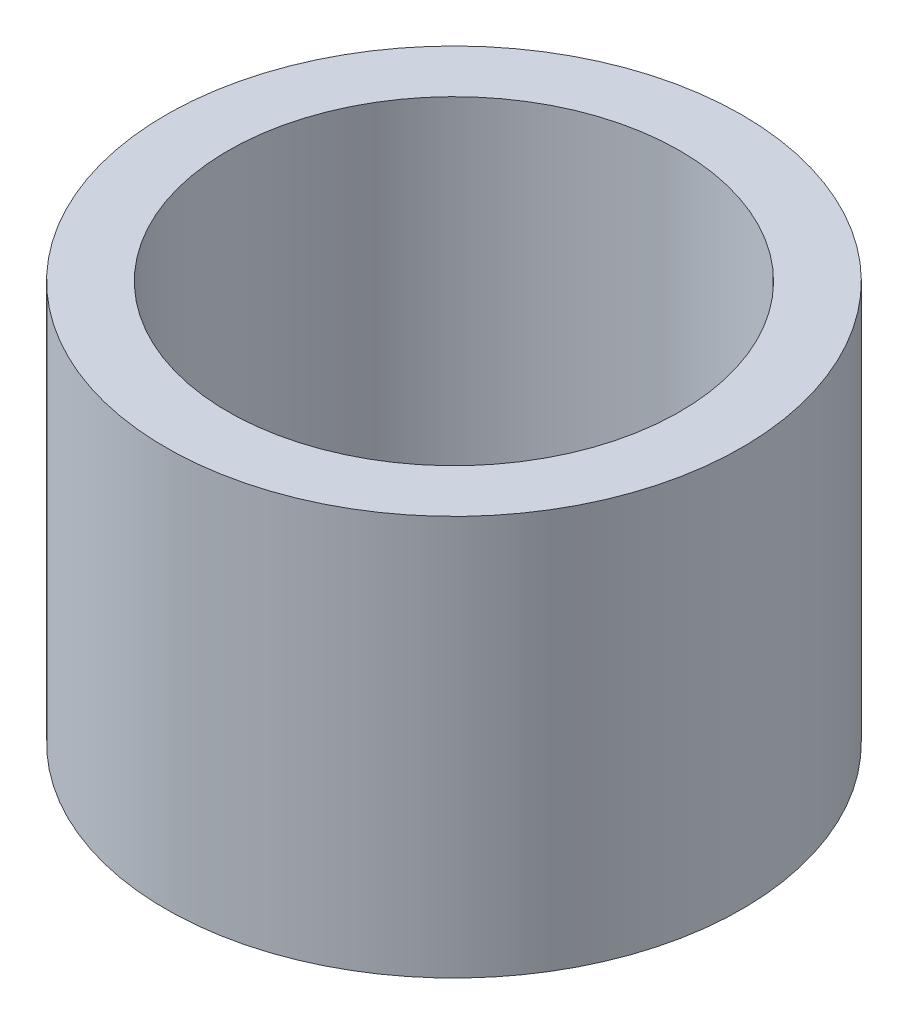
ISO-10303-21;
HEADER;
FILE_DESCRIPTION(('STEP AP214'),'2;1');
FILE_NAME('part.step','',(''),(''),'','','');
FILE_SCHEMA(('AUTOMOTIVE_DESIGN { 1 0 10303 214 1 1 1 1 }'));
ENDSEC;
DATA;
#1=APPLICATION_CONTEXT('core data for automotive mechanical design processes');
#2=APPLICATION_PROTOCOL_DEFINITION('international standard','automotive_design',2000,#1);
#3=PRODUCT_CONTEXT('',#1,'mechanical');
#4=PRODUCT('Part','Part','',(#3));
#5=PRODUCT_RELATED_PRODUCT_CATEGORY('part','',(#4));
#6=PRODUCT_DEFINITION_FORMATION('','',#4);
#7=PRODUCT_DEFINITION_CONTEXT('part definition',#1,'design');
#8=PRODUCT_DEFINITION('design','',#6,#7);
#9=PRODUCT_DEFINITION_SHAPE('','',#8);
#10=(LENGTH_UNIT() NAMED_UNIT(*) SI_UNIT(.MILLI.,.METRE.));
#11=(NAMED_UNIT(*) PLANE_ANGLE_UNIT() SI_UNIT($,.RADIAN.));
#12=(NAMED_UNIT(*) SI_UNIT($,.STERADIAN.) SOLID_ANGLE_UNIT());
#13=UNCERTAINTY_MEASURE_WITH_UNIT(LENGTH_MEASURE(1.E-05),#10,'distance_accuracy_value','');
#14=(GEOMETRIC_REPRESENTATION_CONTEXT(3) GLOBAL_UNCERTAINTY_ASSIGNED_CONTEXT((#13)) GLOBAL_UNIT_ASSIGNED_CONTEXT((#10,
#11,#12)) REPRESENTATION_CONTEXT('',''));
#15=CARTESIAN_POINT('',(0.,0.,0.));
#16=DIRECTION('',(0.,0.,1.));
#17=DIRECTION('',(1.,0.,0.));
#18=AXIS2_PLACEMENT_3D('',#15,#16,#17);
#19=CARTESIAN_POINT('',(0.,27.758871840927,0.));
#20=DIRECTION('',(0.,-1.,0.));
#21=DIRECTION('',(0.,0.,-1.));
#22=AXIS2_PLACEMENT_3D('',#19,#20,#21);
#23=CYLINDRICAL_SURFACE('',#22,20.);
#24=CARTESIAN_POINT('',(0.,27.758871840927,0.));
#25=DIRECTION('',(0.,1.,0.));
#26=DIRECTION('',(0.,0.,1.));
#27=AXIS2_PLACEMENT_3D('',#24,#25,#26);
#28=CIRCLE('',#27,20.);
#29=CARTESIAN_POINT('',(0.,27.758871840927,-20.));
#30=VERTEX_POINT('',#29);
#31=EDGE_CURVE('E10',#30,#30,#28,.T.);
#32=CARTESIAN_POINT('',(0.,0.,0.));
#33=DIRECTION('',(0.,1.,0.));
#34=DIRECTION('',(0.,0.,1.));
#35=AXIS2_PLACEMENT_3D('',#32,#33,#34);
#36=CIRCLE('',#35,20.);
#37=CARTESIAN_POINT('',(0.,0.,-20.));
#38=VERTEX_POINT('',#37);
#39=EDGE_CURVE('E37',#38,#38,#36,.T.);
#40=CARTESIAN_POINT('',(0.,27.758871840927,-20.));
#41=CARTESIAN_POINT('',(0.,27.4697169259173,-20.));
#42=CARTESIAN_POINT('',(0.,27.1805620109077,-20.));
#43=CARTESIAN_POINT('',(0.,26.6022521808884,-20.));
#44=CARTESIAN_POINT('',(0.,26.3130972658787,-20.));
#45=CARTESIAN_POINT('',(0.,25.7347874358594,-20.));
#46=CARTESIAN_POINT('',(0.,25.4456325208497,-20.));
#47=CARTESIAN_POINT('',(0.,24.8673226908304,-20.));
#48=CARTESIAN_POINT('',(0.,24.5781677758208,-20.));
#49=CARTESIAN_POINT('',(0.,23.9998579458015,-20.));
#50=CARTESIAN_POINT('',(0.,23.7107030307918,-20.));
#51=CARTESIAN_POINT('',(0.,23.1323932007725,-20.));
#52=CARTESIAN_POINT('',(0.,22.8432382857628,-20.));
#53=CARTESIAN_POINT('',(0.,22.2649284557435,-20.));
#54=CARTESIAN_POINT('',(0.,21.9757735407339,-20.));
#55=CARTESIAN_POINT('',(0.,21.3974637107146,-20.));
#56=CARTESIAN_POINT('',(0.,21.1083087957049,-20.));
#57=CARTESIAN_POINT('',(0.,20.5299989656856,-20.));
#58=CARTESIAN_POINT('',(0.,20.2408440506759,-20.));
#59=CARTESIAN_POINT('',(0.,19.6625342206566,-20.));
#60=CARTESIAN_POINT('',(0.,19.373379305647,-20.));
#61=CARTESIAN_POINT('',(0.,18.7950694756276,-20.));
#62=CARTESIAN_POINT('',(0.,18.505914560618,-20.));
#63=CARTESIAN_POINT('',(0.,17.9276047305987,-20.));
#64=CARTESIAN_POINT('',(0.,17.638449815589,-20.));
#65=CARTESIAN_POINT('',(0.,17.0601399855697,-20.));
#66=CARTESIAN_POINT('',(0.,16.7709850705601,-20.));
#67=CARTESIAN_POINT('',(0.,16.1926752405407,-20.));
#68=CARTESIAN_POINT('',(0.,15.9035203255311,-20.));
#69=CARTESIAN_POINT('',(0.,15.3252104955118,-20.));
#70=CARTESIAN_POINT('',(0.,15.0360555805021,-20.));
#71=CARTESIAN_POINT('',(0.,14.4577457504828,-20.));
#72=CARTESIAN_POINT('',(0.,14.1685908354731,-20.));
#73=CARTESIAN_POINT('',(0.,13.5902810054538,-20.));
#74=CARTESIAN_POINT('',(0.,13.3011260904442,-20.));
#75=CARTESIAN_POINT('',(0.,12.7228162604249,-20.));
#76=CARTESIAN_POINT('',(0.,12.4336613454152,-20.));
#77=CARTESIAN_POINT('',(0.,11.8553515153959,-20.));
#78=CARTESIAN_POINT('',(0.,11.5661966003862,-20.));
#79=CARTESIAN_POINT('',(0.,10.9878867703669,-20.));
#80=CARTESIAN_POINT('',(0.,10.6987318553573,-20.));
#81=CARTESIAN_POINT('',(0.,10.120422025338,-20.));
#82=CARTESIAN_POINT('',(0.,9.83126711032831,-20.));
#83=CARTESIAN_POINT('',(0.,9.252957280309,-20.));
#84=CARTESIAN_POINT('',(0.,8.96380236529934,-20.));
#85=CARTESIAN_POINT('',(0.,8.38549253528003,-20.));
#86=CARTESIAN_POINT('',(0.,8.09633762027037,-20.));
#87=CARTESIAN_POINT('',(0.,7.51802779025106,-20.));
#88=CARTESIAN_POINT('',(0.,7.2288728752414,-20.));
#89=CARTESIAN_POINT('',(0.,6.65056304522209,-20.));
#90=CARTESIAN_POINT('',(0.,6.36140813021243,-20.));
#91=CARTESIAN_POINT('',(0.,5.78309830019312,-20.));
#92=CARTESIAN_POINT('',(0.,5.49394338518347,-20.));
#93=CARTESIAN_POINT('',(0.,4.91563355516416,-20.));
#94=CARTESIAN_POINT('',(0.,4.6264786401545,-20.));
#95=CARTESIAN_POINT('',(0.,4.04816881013519,-20.));
#96=CARTESIAN_POINT('',(0.,3.75901389512553,-20.));
#97=CARTESIAN_POINT('',(0.,3.18070406510622,-20.));
#98=CARTESIAN_POINT('',(0.,2.89154915009656,-20.));
#99=CARTESIAN_POINT('',(0.,2.31323932007725,-20.));
#100=CARTESIAN_POINT('',(0.,2.02408440506759,-20.));
#101=CARTESIAN_POINT('',(0.,1.44577457504828,-20.));
#102=CARTESIAN_POINT('',(0.,1.15661966003862,-20.));
#103=CARTESIAN_POINT('',(0.,0.578309830019312,-20.));
#104=CARTESIAN_POINT('',(0.,0.289154915009656,-20.));
#105=CARTESIAN_POINT('',(0.,0.,-20.));
#106=B_SPLINE_CURVE_WITH_KNOTS('',3,(#40,#41,#42,#43,#44,#45,#46,#47,#48,#49,#50,#51,#52,#53,
#54,#55,#56,#57,#58,#59,#60,#61,#62,#63,#64,#65,#66,#67,#68,#69,#70,#71,#72,#73,#74,#75,#76,#77,
#78,#79,#80,#81,#82,#83,#84,#85,#86,#87,#88,#89,#90,#91,#92,#93,#94,#95,#96,#97,#98,#99,#100,
#101,#102,#103,#104,#105),.UNSPECIFIED.,.F.,.F.,(4,2,2,2,2,2,2,2,2,2,2,2,2,2,2,2,2,2,2,2,2,2,2,
2,2,2,2,2,2,2,2,2,4),(0.,0.867464745028971,1.73492949005794,2.60239423508691,3.46985898011588,
4.33732372514484,5.20478847017381,6.07225321520278,6.93971796023175,7.80718270526072,
8.67464745028968,9.54211219531865,10.4095769403476,11.2770416853766,12.1445064304056,
13.0119711754345,13.8794359204635,14.7469006654925,15.6143654105214,16.4818301555504,
17.3492949005794,18.2167596456083,19.0842243906373,19.9516891356663,20.8191538806952,
21.6866186257242,22.5540833707532,23.4215481157821,24.2890128608111,25.1564776058401,
26.023942350869,26.891407095898,27.758871840927),.UNSPECIFIED.);
#107=EDGE_CURVE('BSEAM40',#30,#38,#106,.T.);
#108=ORIENTED_EDGE('',*,*,#31,.F.);
#109=ORIENTED_EDGE('',*,*,#39,.T.);
#110=ORIENTED_EDGE('',*,*,#107,.T.);
#111=ORIENTED_EDGE('',*,*,#107,.F.);
#112=EDGE_LOOP('',(#108,#110,#109,#111));
#113=FACE_BOUND('',#112,.T.);
#114=ADVANCED_FACE('F40',(#113),#23,.T.);
#115=CARTESIAN_POINT('',(0.,27.758871840927,0.));
#116=DIRECTION('',(0.,1.,0.));
#117=DIRECTION('',(0.,0.,1.));
#118=AXIS2_PLACEMENT_3D('',#115,#116,#117);
#119=PLANE('',#118);
#120=CARTESIAN_POINT('',(0.,27.758871840927,0.));
#121=DIRECTION('',(0.,1.,0.));
#122=DIRECTION('',(0.,0.,1.));
#123=AXIS2_PLACEMENT_3D('',#120,#121,#122);
#124=CIRCLE('',#123,15.6917866966651);
#125=CARTESIAN_POINT('',(0.,27.758871840927,-15.6917866966651));
#126=VERTEX_POINT('',#125);
#127=EDGE_CURVE('E50',#126,#126,#124,.T.);
#128=ORIENTED_EDGE('',*,*,#127,.F.);
#129=EDGE_LOOP('',(#128));
#130=FACE_BOUND('',#129,.T.);
#131=ORIENTED_EDGE('',*,*,#31,.T.);
#132=EDGE_LOOP('',(#131));
#133=FACE_BOUND('',#132,.T.);
#134=ADVANCED_FACE('F59',(#130,#133),#119,.T.);
#135=CARTESIAN_POINT('',(0.,0.,0.));
#136=DIRECTION('',(0.,1.,0.));
#137=DIRECTION('',(0.,0.,1.));
#138=AXIS2_PLACEMENT_3D('',#135,#136,#137);
#139=PLANE('',#138);
#140=CARTESIAN_POINT('',(0.,0.,0.));
#141=DIRECTION('',(0.,1.,0.));
#142=DIRECTION('',(0.,0.,1.));
#143=AXIS2_PLACEMENT_3D('',#140,#141,#142);
#144=CIRCLE('',#143,15.6917866966651);
#145=CARTESIAN_POINT('',(0.,0.,-15.6917866966651));
#146=VERTEX_POINT('',#145);
#147=EDGE_CURVE('E47',#146,#146,#144,.T.);
#148=ORIENTED_EDGE('',*,*,#147,.T.);
#149=EDGE_LOOP('',(#148));
#150=FACE_BOUND('',#149,.T.);
#151=ORIENTED_EDGE('',*,*,#39,.F.);
#152=EDGE_LOOP('',(#151));
#153=FACE_BOUND('',#152,.T.);
#154=ADVANCED_FACE('F58',(#150,#153),#139,.F.);
#155=CARTESIAN_POINT('',(0.,27.758871840927,0.));
#156=DIRECTION('',(0.,-1.,0.));
#157=DIRECTION('',(0.,0.,-1.));
#158=AXIS2_PLACEMENT_3D('',#155,#156,#157);
#159=CYLINDRICAL_SURFACE('',#158,15.6917866966651);
#160=CARTESIAN_POINT('',(0.,27.758871840927,-15.6917866966651));
#161=CARTESIAN_POINT('',(0.,27.4697169259173,-15.6917866966651));
#162=CARTESIAN_POINT('',(0.,27.1805620109077,-15.6917866966651));
#163=CARTESIAN_POINT('',(0.,26.6022521808884,-15.6917866966651));
#164=CARTESIAN_POINT('',(0.,26.3130972658787,-15.6917866966651));
#165=CARTESIAN_POINT('',(0.,25.7347874358594,-15.6917866966651));
#166=CARTESIAN_POINT('',(0.,25.4456325208497,-15.6917866966651));
#167=CARTESIAN_POINT('',(0.,24.8673226908304,-15.6917866966651));
#168=CARTESIAN_POINT('',(0.,24.5781677758208,-15.6917866966651));
#169=CARTESIAN_POINT('',(0.,23.9998579458015,-15.6917866966651));
#170=CARTESIAN_POINT('',(0.,23.7107030307918,-15.6917866966651));
#171=CARTESIAN_POINT('',(0.,23.1323932007725,-15.6917866966651));
#172=CARTESIAN_POINT('',(0.,22.8432382857628,-15.6917866966651));
#173=CARTESIAN_POINT('',(0.,22.2649284557435,-15.6917866966651));
#174=CARTESIAN_POINT('',(0.,21.9757735407339,-15.6917866966651));
#175=CARTESIAN_POINT('',(0.,21.3974637107146,-15.6917866966651));
#176=CARTESIAN_POINT('',(0.,21.1083087957049,-15.6917866966651));
#177=CARTESIAN_POINT('',(0.,20.5299989656856,-15.6917866966651));
#178=CARTESIAN_POINT('',(0.,20.2408440506759,-15.6917866966651));
#179=CARTESIAN_POINT('',(0.,19.6625342206566,-15.6917866966651));
#180=CARTESIAN_POINT('',(0.,19.373379305647,-15.6917866966651));
#181=CARTESIAN_POINT('',(0.,18.7950694756276,-15.6917866966651));
#182=CARTESIAN_POINT('',(0.,18.505914560618,-15.6917866966651));
#183=CARTESIAN_POINT('',(0.,17.9276047305987,-15.6917866966651));
#184=CARTESIAN_POINT('',(0.,17.638449815589,-15.6917866966651));
#185=CARTESIAN_POINT('',(0.,17.0601399855697,-15.6917866966651));
#186=CARTESIAN_POINT('',(0.,16.7709850705601,-15.6917866966651));
#187=CARTESIAN_POINT('',(0.,16.1926752405407,-15.6917866966651));
#188=CARTESIAN_POINT('',(0.,15.9035203255311,-15.6917866966651));
#189=CARTESIAN_POINT('',(0.,15.3252104955118,-15.6917866966651));
#190=CARTESIAN_POINT('',(0.,15.0360555805021,-15.6917866966651));
#191=CARTESIAN_POINT('',(0.,14.4577457504828,-15.6917866966651));
#192=CARTESIAN_POINT('',(0.,14.1685908354732,-15.6917866966651));
#193=CARTESIAN_POINT('',(0.,13.5902810054538,-15.6917866966651));
#194=CARTESIAN_POINT('',(0.,13.3011260904442,-15.6917866966651));
#195=CARTESIAN_POINT('',(0.,12.7228162604249,-15.6917866966651));
#196=CARTESIAN_POINT('',(0.,12.4336613454152,-15.6917866966651));
#197=CARTESIAN_POINT('',(0.,11.8553515153959,-15.6917866966651));
#198=CARTESIAN_POINT('',(0.,11.5661966003862,-15.6917866966651));
#199=CARTESIAN_POINT('',(0.,10.9878867703669,-15.6917866966651));
#200=CARTESIAN_POINT('',(0.,10.6987318553573,-15.6917866966651));
#201=CARTESIAN_POINT('',(0.,10.120422025338,-15.6917866966651));
#202=CARTESIAN_POINT('',(0.,9.83126711032831,-15.6917866966651));
#203=CARTESIAN_POINT('',(0.,9.252957280309,-15.6917866966651));
#204=CARTESIAN_POINT('',(0.,8.96380236529934,-15.6917866966651));
#205=CARTESIAN_POINT('',(0.,8.38549253528003,-15.6917866966651));
#206=CARTESIAN_POINT('',(0.,8.09633762027037,-15.6917866966651));
#207=CARTESIAN_POINT('',(0.,7.51802779025106,-15.6917866966651));
#208=CARTESIAN_POINT('',(0.,7.2288728752414,-15.6917866966651));
#209=CARTESIAN_POINT('',(0.,6.65056304522209,-15.6917866966651));
#210=CARTESIAN_POINT('',(0.,6.36140813021243,-15.6917866966651));
#211=CARTESIAN_POINT('',(0.,5.78309830019312,-15.6917866966651));
#212=CARTESIAN_POINT('',(0.,5.49394338518347,-15.6917866966651));
#213=CARTESIAN_POINT('',(0.,4.91563355516415,-15.6917866966651));
#214=CARTESIAN_POINT('',(0.,4.6264786401545,-15.6917866966651));
#215=CARTESIAN_POINT('',(0.,4.04816881013519,-15.6917866966651));
#216=CARTESIAN_POINT('',(0.,3.75901389512553,-15.6917866966651));
#217=CARTESIAN_POINT('',(0.,3.18070406510622,-15.6917866966651));
#218=CARTESIAN_POINT('',(0.,2.89154915009656,-15.6917866966651));
#219=CARTESIAN_POINT('',(0.,2.31323932007725,-15.6917866966651));
#220=CARTESIAN_POINT('',(0.,2.02408440506759,-15.6917866966651));
#221=CARTESIAN_POINT('',(0.,1.44577457504828,-15.6917866966651));
#222=CARTESIAN_POINT('',(0.,1.15661966003862,-15.6917866966651));
#223=CARTESIAN_POINT('',(0.,0.578309830019312,-15.6917866966651));
#224=CARTESIAN_POINT('',(0.,0.289154915009656,-15.6917866966651));
#225=CARTESIAN_POINT('',(0.,0.,-15.6917866966651));
#226=B_SPLINE_CURVE_WITH_KNOTS('',3,(#160,#161,#162,#163,#164,#165,#166,#167,#168,#169,#170,
#171,#172,#173,#174,#175,#176,#177,#178,#179,#180,#181,#182,#183,#184,#185,#186,#187,#188,#189,
#190,#191,#192,#193,#194,#195,#196,#197,#198,#199,#200,#201,#202,#203,#204,#205,#206,#207,#208,
#209,#210,#211,#212,#213,#214,#215,#216,#217,#218,#219,#220,#221,#222,#223,#224,#225),
.UNSPECIFIED.,.F.,.F.,(4,2,2,2,2,2,2,2,2,2,2,2,2,2,2,2,2,2,2,2,2,2,2,2,2,2,2,2,2,2,2,2,4),(0.,
0.867464745028967,1.73492949005793,2.6023942350869,3.46985898011587,4.33732372514484,
5.20478847017381,6.07225321520278,6.93971796023175,7.80718270526071,8.67464745028968,
9.54211219531865,10.4095769403476,11.2770416853766,12.1445064304056,13.0119711754345,
13.8794359204635,14.7469006654925,15.6143654105214,16.4818301555504,17.3492949005794,
18.2167596456083,19.0842243906373,19.9516891356663,20.8191538806952,21.6866186257242,
22.5540833707532,23.4215481157821,24.2890128608111,25.1564776058401,26.023942350869,
26.891407095898,27.758871840927),.UNSPECIFIED.);
#227=EDGE_CURVE('BSEAM54',#126,#146,#226,.T.);
#228=ORIENTED_EDGE('',*,*,#127,.T.);
#229=ORIENTED_EDGE('',*,*,#147,.F.);
#230=ORIENTED_EDGE('',*,*,#227,.T.);
#231=ORIENTED_EDGE('',*,*,#227,.F.);
#232=EDGE_LOOP('',(#228,#230,#229,#231));
#233=FACE_BOUND('',#232,.T.);
#234=ADVANCED_FACE('F54',(#233),#159,.F.);
#235=CLOSED_SHELL('',(#114,#134,#154,#234));
#236=MANIFOLD_SOLID_BREP('B2',#235);
#237=ADVANCED_BREP_SHAPE_REPRESENTATION('',(#18,#236),#14);
#238=SHAPE_DEFINITION_REPRESENTATION(#9,#237);
ENDSEC;
END-ISO-10303-21;
